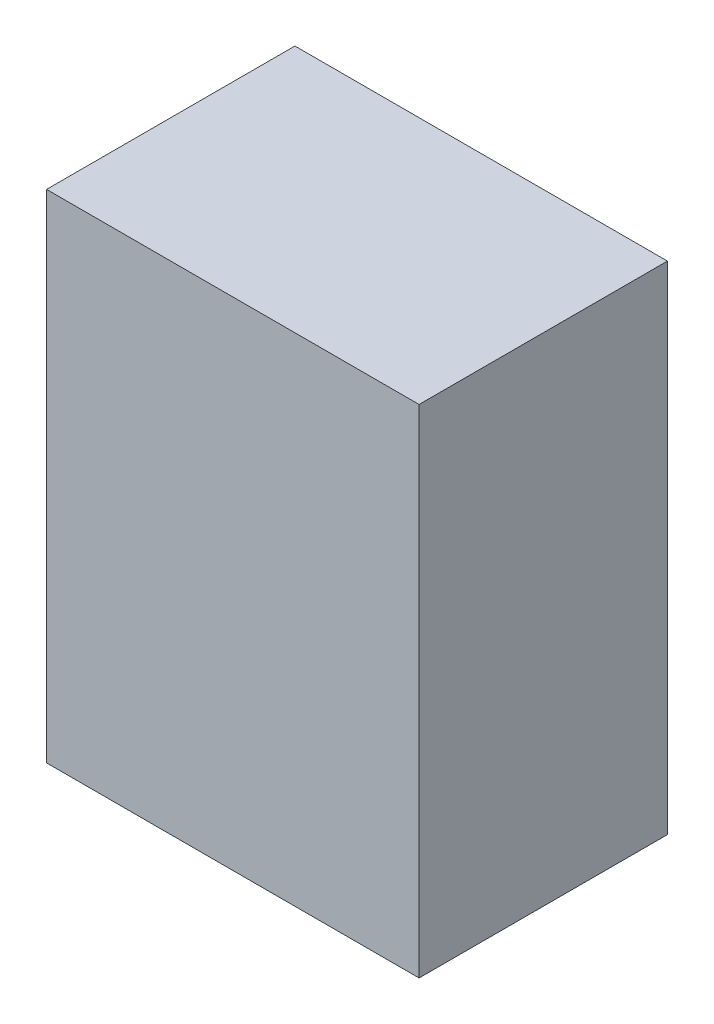
ISO-10303-21;
HEADER;
FILE_DESCRIPTION(('STEP AP214'),'2;1');
FILE_NAME('part.step','',(''),(''),'','','');
FILE_SCHEMA(('AUTOMOTIVE_DESIGN { 1 0 10303 214 1 1 1 1 }'));
ENDSEC;
DATA;
#1=APPLICATION_CONTEXT('core data for automotive mechanical design processes');
#2=APPLICATION_PROTOCOL_DEFINITION('international standard','automotive_design',2000,#1);
#3=PRODUCT_CONTEXT('',#1,'mechanical');
#4=PRODUCT('Part','Part','',(#3));
#5=PRODUCT_RELATED_PRODUCT_CATEGORY('part','',(#4));
#6=PRODUCT_DEFINITION_FORMATION('','',#4);
#7=PRODUCT_DEFINITION_CONTEXT('part definition',#1,'design');
#8=PRODUCT_DEFINITION('design','',#6,#7);
#9=PRODUCT_DEFINITION_SHAPE('','',#8);
#10=(LENGTH_UNIT() NAMED_UNIT(*) SI_UNIT(.MILLI.,.METRE.));
#11=(NAMED_UNIT(*) PLANE_ANGLE_UNIT() SI_UNIT($,.RADIAN.));
#12=(NAMED_UNIT(*) SI_UNIT($,.STERADIAN.) SOLID_ANGLE_UNIT());
#13=UNCERTAINTY_MEASURE_WITH_UNIT(LENGTH_MEASURE(1.E-05),#10,'distance_accuracy_value','');
#14=(GEOMETRIC_REPRESENTATION_CONTEXT(3) GLOBAL_UNCERTAINTY_ASSIGNED_CONTEXT((#13)) GLOBAL_UNIT_ASSIGNED_CONTEXT((#10,
#11,#12)) REPRESENTATION_CONTEXT('',''));
#15=CARTESIAN_POINT('',(0.,0.,0.));
#16=DIRECTION('',(0.,0.,1.));
#17=DIRECTION('',(1.,0.,0.));
#18=AXIS2_PLACEMENT_3D('',#15,#16,#17);
#19=CARTESIAN_POINT('',(0.,50.8,0.));
#20=DIRECTION('',(1.,0.,0.));
#21=DIRECTION('',(0.,0.,-1.));
#22=AXIS2_PLACEMENT_3D('',#19,#20,#21);
#23=PLANE('',#22);
#24=DIRECTION('',(0.,0.,1.));
#25=VECTOR('',#24,1.);
#26=CARTESIAN_POINT('',(0.,0.,0.));
#27=LINE('',#26,#25);
#28=CARTESIAN_POINT('',(0.,0.,-25.4));
#29=VERTEX_POINT('',#28);
#30=CARTESIAN_POINT('',(0.,0.,0.));
#31=VERTEX_POINT('',#30);
#32=EDGE_CURVE('E96',#29,#31,#27,.T.);
#33=ORIENTED_EDGE('',*,*,#32,.T.);
#34=DIRECTION('',(0.,-1.,0.));
#35=VECTOR('',#34,1.);
#36=CARTESIAN_POINT('',(0.,50.8,0.));
#37=LINE('',#36,#35);
#38=CARTESIAN_POINT('',(0.,50.8,0.));
#39=VERTEX_POINT('',#38);
#40=EDGE_CURVE('E11',#39,#31,#37,.T.);
#41=ORIENTED_EDGE('',*,*,#40,.F.);
#42=DIRECTION('',(0.,0.,1.));
#43=VECTOR('',#42,1.);
#44=CARTESIAN_POINT('',(0.,50.8,0.));
#45=LINE('',#44,#43);
#46=CARTESIAN_POINT('',(0.,50.8,-25.4));
#47=VERTEX_POINT('',#46);
#48=EDGE_CURVE('E84',#47,#39,#45,.T.);
#49=ORIENTED_EDGE('',*,*,#48,.F.);
#50=DIRECTION('',(0.,-1.,0.));
#51=VECTOR('',#50,1.);
#52=CARTESIAN_POINT('',(0.,50.8,-25.4));
#53=LINE('',#52,#51);
#54=EDGE_CURVE('E92',#47,#29,#53,.T.);
#55=ORIENTED_EDGE('',*,*,#54,.T.);
#56=EDGE_LOOP('',(#33,#41,#49,#55));
#57=FACE_BOUND('',#56,.T.);
#58=ADVANCED_FACE('F33',(#57),#23,.F.);
#59=CARTESIAN_POINT('',(0.,50.8,0.));
#60=DIRECTION('',(0.,0.,-1.));
#61=DIRECTION('',(-1.,0.,0.));
#62=AXIS2_PLACEMENT_3D('',#59,#60,#61);
#63=PLANE('',#62);
#64=DIRECTION('',(1.,0.,0.));
#65=VECTOR('',#64,1.);
#66=CARTESIAN_POINT('',(0.,0.,0.));
#67=LINE('',#66,#65);
#68=CARTESIAN_POINT('',(38.1,0.,0.));
#69=VERTEX_POINT('',#68);
#70=EDGE_CURVE('E88',#31,#69,#67,.T.);
#71=ORIENTED_EDGE('',*,*,#70,.T.);
#72=DIRECTION('',(0.,-1.,0.));
#73=VECTOR('',#72,1.);
#74=CARTESIAN_POINT('',(38.1,50.8,0.));
#75=LINE('',#74,#73);
#76=CARTESIAN_POINT('',(38.1,50.8,0.));
#77=VERTEX_POINT('',#76);
#78=EDGE_CURVE('E41',#77,#69,#75,.T.);
#79=ORIENTED_EDGE('',*,*,#78,.F.);
#80=DIRECTION('',(1.,0.,0.));
#81=VECTOR('',#80,1.);
#82=CARTESIAN_POINT('',(0.,50.8,0.));
#83=LINE('',#82,#81);
#84=EDGE_CURVE('E79',#39,#77,#83,.T.);
#85=ORIENTED_EDGE('',*,*,#84,.F.);
#86=ORIENTED_EDGE('',*,*,#40,.T.);
#87=EDGE_LOOP('',(#71,#79,#85,#86));
#88=FACE_BOUND('',#87,.T.);
#89=ADVANCED_FACE('F87',(#88),#63,.F.);
#90=CARTESIAN_POINT('',(38.1,50.8,0.));
#91=DIRECTION('',(-1.,0.,0.));
#92=DIRECTION('',(0.,0.,1.));
#93=AXIS2_PLACEMENT_3D('',#90,#91,#92);
#94=PLANE('',#93);
#95=DIRECTION('',(0.,0.,-1.));
#96=VECTOR('',#95,1.);
#97=CARTESIAN_POINT('',(38.1,0.,0.));
#98=LINE('',#97,#96);
#99=CARTESIAN_POINT('',(38.1,0.,-25.4));
#100=VERTEX_POINT('',#99);
#101=EDGE_CURVE('E66',#69,#100,#98,.T.);
#102=ORIENTED_EDGE('',*,*,#101,.T.);
#103=DIRECTION('',(0.,-1.,0.));
#104=VECTOR('',#103,1.);
#105=CARTESIAN_POINT('',(38.1,50.8,-25.4));
#106=LINE('',#105,#104);
#107=CARTESIAN_POINT('',(38.1,50.8,-25.4));
#108=VERTEX_POINT('',#107);
#109=EDGE_CURVE('E89',#108,#100,#106,.T.);
#110=ORIENTED_EDGE('',*,*,#109,.F.);
#111=DIRECTION('',(0.,0.,-1.));
#112=VECTOR('',#111,1.);
#113=CARTESIAN_POINT('',(38.1,50.8,0.));
#114=LINE('',#113,#112);
#115=EDGE_CURVE('E82',#77,#108,#114,.T.);
#116=ORIENTED_EDGE('',*,*,#115,.F.);
#117=ORIENTED_EDGE('',*,*,#78,.T.);
#118=EDGE_LOOP('',(#102,#110,#116,#117));
#119=FACE_BOUND('',#118,.T.);
#120=ADVANCED_FACE('F90',(#119),#94,.F.);
#121=CARTESIAN_POINT('',(0.,50.8,-25.4));
#122=DIRECTION('',(0.,0.,1.));
#123=DIRECTION('',(1.,0.,0.));
#124=AXIS2_PLACEMENT_3D('',#121,#122,#123);
#125=PLANE('',#124);
#126=DIRECTION('',(-1.,0.,0.));
#127=VECTOR('',#126,1.);
#128=CARTESIAN_POINT('',(0.,0.,-25.4));
#129=LINE('',#128,#127);
#130=EDGE_CURVE('E72',#100,#29,#129,.T.);
#131=ORIENTED_EDGE('',*,*,#130,.T.);
#132=ORIENTED_EDGE('',*,*,#54,.F.);
#133=DIRECTION('',(-1.,0.,0.));
#134=VECTOR('',#133,1.);
#135=CARTESIAN_POINT('',(0.,50.8,-25.4));
#136=LINE('',#135,#134);
#137=EDGE_CURVE('E49',#108,#47,#136,.T.);
#138=ORIENTED_EDGE('',*,*,#137,.F.);
#139=ORIENTED_EDGE('',*,*,#109,.T.);
#140=EDGE_LOOP('',(#131,#132,#138,#139));
#141=FACE_BOUND('',#140,.T.);
#142=ADVANCED_FACE('F103',(#141),#125,.F.);
#143=CARTESIAN_POINT('',(0.,50.8,0.));
#144=DIRECTION('',(0.,-1.,0.));
#145=DIRECTION('',(0.,0.,-1.));
#146=AXIS2_PLACEMENT_3D('',#143,#144,#145);
#147=PLANE('',#146);
#148=ORIENTED_EDGE('',*,*,#48,.T.);
#149=ORIENTED_EDGE('',*,*,#84,.T.);
#150=ORIENTED_EDGE('',*,*,#115,.T.);
#151=ORIENTED_EDGE('',*,*,#137,.T.);
#152=EDGE_LOOP('',(#148,#149,#150,#151));
#153=FACE_BOUND('',#152,.T.);
#154=ADVANCED_FACE('F80',(#153),#147,.F.);
#155=CARTESIAN_POINT('',(0.,0.,0.));
#156=DIRECTION('',(0.,-1.,0.));
#157=DIRECTION('',(0.,0.,-1.));
#158=AXIS2_PLACEMENT_3D('',#155,#156,#157);
#159=PLANE('',#158);
#160=ORIENTED_EDGE('',*,*,#32,.F.);
#161=ORIENTED_EDGE('',*,*,#130,.F.);
#162=ORIENTED_EDGE('',*,*,#101,.F.);
#163=ORIENTED_EDGE('',*,*,#70,.F.);
#164=EDGE_LOOP('',(#160,#161,#162,#163));
#165=FACE_BOUND('',#164,.T.);
#166=ADVANCED_FACE('F106',(#165),#159,.T.);
#167=CLOSED_SHELL('',(#58,#89,#120,#142,#154,#166));
#168=MANIFOLD_SOLID_BREP('B2',#167);
#169=ADVANCED_BREP_SHAPE_REPRESENTATION('',(#18,#168),#14);
#170=SHAPE_DEFINITION_REPRESENTATION(#9,#169);
ENDSEC;
END-ISO-10303-21;
